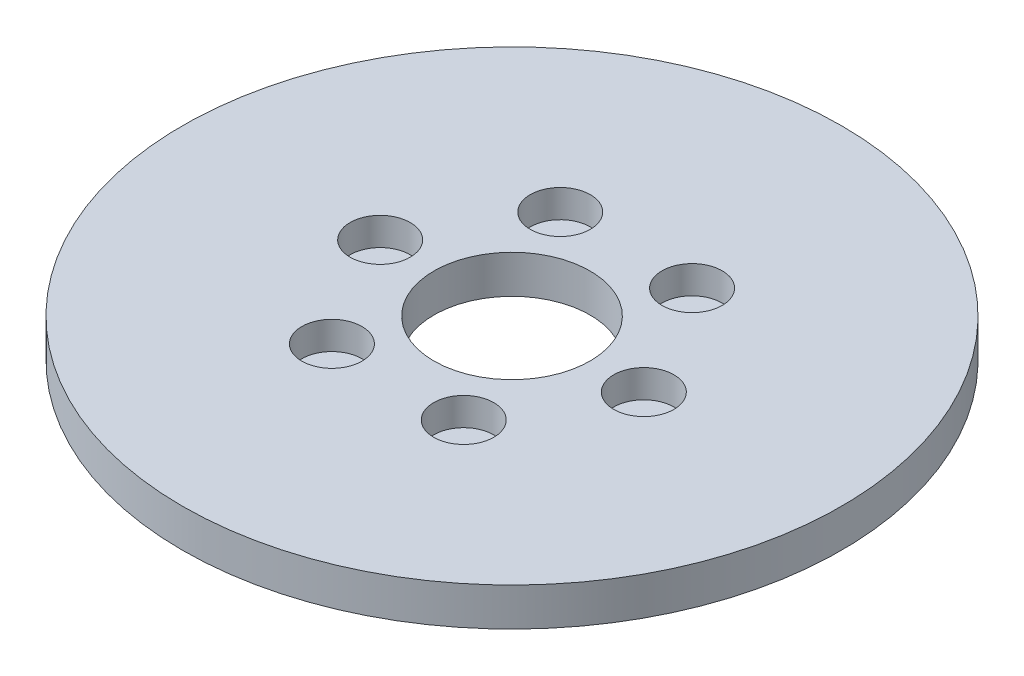
ISO-10303-21;
HEADER;
FILE_DESCRIPTION(('STEP AP214'),'2;1');
FILE_NAME('part.step','',(''),(''),'','','');
FILE_SCHEMA(('AUTOMOTIVE_DESIGN { 1 0 10303 214 1 1 1 1 }'));
ENDSEC;
DATA;
#1=APPLICATION_CONTEXT('core data for automotive mechanical design processes');
#2=APPLICATION_PROTOCOL_DEFINITION('international standard','automotive_design',2000,#1);
#3=PRODUCT_CONTEXT('',#1,'mechanical');
#4=PRODUCT('Part','Part','',(#3));
#5=PRODUCT_RELATED_PRODUCT_CATEGORY('part','',(#4));
#6=PRODUCT_DEFINITION_FORMATION('','',#4);
#7=PRODUCT_DEFINITION_CONTEXT('part definition',#1,'design');
#8=PRODUCT_DEFINITION('design','',#6,#7);
#9=PRODUCT_DEFINITION_SHAPE('','',#8);
#10=(LENGTH_UNIT() NAMED_UNIT(*) SI_UNIT(.MILLI.,.METRE.));
#11=(NAMED_UNIT(*) PLANE_ANGLE_UNIT() SI_UNIT($,.RADIAN.));
#12=(NAMED_UNIT(*) SI_UNIT($,.STERADIAN.) SOLID_ANGLE_UNIT());
#13=UNCERTAINTY_MEASURE_WITH_UNIT(LENGTH_MEASURE(1.E-05),#10,'distance_accuracy_value','');
#14=(GEOMETRIC_REPRESENTATION_CONTEXT(3) GLOBAL_UNCERTAINTY_ASSIGNED_CONTEXT((#13)) GLOBAL_UNIT_ASSIGNED_CONTEXT((#10,
#11,#12)) REPRESENTATION_CONTEXT('',''));
#15=CARTESIAN_POINT('',(0.,0.,0.));
#16=DIRECTION('',(0.,0.,1.));
#17=DIRECTION('',(1.,0.,0.));
#18=AXIS2_PLACEMENT_3D('',#15,#16,#17);
#19=CARTESIAN_POINT('',(0.,11.,0.));
#20=DIRECTION('',(0.,-1.,0.));
#21=DIRECTION('',(0.,0.,-1.));
#22=AXIS2_PLACEMENT_3D('',#19,#20,#21);
#23=CYLINDRICAL_SURFACE('',#22,95.);
#24=CARTESIAN_POINT('',(0.,11.,0.));
#25=DIRECTION('',(0.,1.,0.));
#26=DIRECTION('',(0.,0.,1.));
#27=AXIS2_PLACEMENT_3D('',#24,#25,#26);
#28=CIRCLE('',#27,95.);
#29=CARTESIAN_POINT('',(0.,11.,95.));
#30=VERTEX_POINT('',#29);
#31=EDGE_CURVE('E10',#30,#30,#28,.T.);
#32=ORIENTED_EDGE('',*,*,#31,.F.);
#33=EDGE_LOOP('',(#32));
#34=FACE_BOUND('',#33,.T.);
#35=CARTESIAN_POINT('',(0.,0.,0.));
#36=DIRECTION('',(0.,1.,0.));
#37=DIRECTION('',(0.,0.,1.));
#38=AXIS2_PLACEMENT_3D('',#35,#36,#37);
#39=CIRCLE('',#38,95.);
#40=CARTESIAN_POINT('',(0.,0.,95.));
#41=VERTEX_POINT('',#40);
#42=EDGE_CURVE('E37',#41,#41,#39,.T.);
#43=ORIENTED_EDGE('',*,*,#42,.T.);
#44=EDGE_LOOP('',(#43));
#45=FACE_BOUND('',#44,.T.);
#46=ADVANCED_FACE('F40',(#34,#45),#23,.T.);
#47=CARTESIAN_POINT('',(0.,11.,0.));
#48=DIRECTION('',(0.,1.,0.));
#49=DIRECTION('',(0.,0.,1.));
#50=AXIS2_PLACEMENT_3D('',#47,#48,#49);
#51=PLANE('',#50);
#52=CARTESIAN_POINT('',(-19.0021668198677,11.,-32.9127183859094));
#53=DIRECTION('',(0.,1.,0.));
#54=DIRECTION('',(-0.866025403784433,0.,0.50000000000001));
#55=AXIS2_PLACEMENT_3D('',#52,#53,#54);
#56=CIRCLE('',#55,8.66608825598178);
#57=CARTESIAN_POINT('',(-26.5072194009858,11.,-28.5796742579184));
#58=VERTEX_POINT('',#57);
#59=EDGE_CURVE('E70',#58,#58,#56,.T.);
#60=ORIENTED_EDGE('',*,*,#59,.F.);
#61=EDGE_LOOP('',(#60));
#62=FACE_BOUND('',#61,.T.);
#63=CARTESIAN_POINT('',(19.002166819867,11.,-32.9127183859098));
#64=DIRECTION('',(0.,1.,0.));
#65=DIRECTION('',(-0.866025403784443,0.,-0.499999999999992));
#66=AXIS2_PLACEMENT_3D('',#63,#64,#65);
#67=CIRCLE('',#66,8.66608825598178);
#68=CARTESIAN_POINT('',(11.4971142387487,11.,-37.2457625139006));
#69=VERTEX_POINT('',#68);
#70=EDGE_CURVE('E71',#69,#69,#67,.T.);
#71=ORIENTED_EDGE('',*,*,#70,.F.);
#72=EDGE_LOOP('',(#71));
#73=FACE_BOUND('',#72,.T.);
#74=CARTESIAN_POINT('',(38.0043336397345,11.,0.));
#75=DIRECTION('',(0.,1.,0.));
#76=DIRECTION('',(0.,0.,-1.));
#77=AXIS2_PLACEMENT_3D('',#74,#75,#76);
#78=CIRCLE('',#77,8.66608825598178);
#79=CARTESIAN_POINT('',(38.0043336397345,11.,-8.66608825598178));
#80=VERTEX_POINT('',#79);
#81=EDGE_CURVE('E78',#80,#80,#78,.T.);
#82=ORIENTED_EDGE('',*,*,#81,.F.);
#83=EDGE_LOOP('',(#82));
#84=FACE_BOUND('',#83,.T.);
#85=CARTESIAN_POINT('',(19.0021668198674,11.,32.9127183859095));
#86=DIRECTION('',(0.,1.,0.));
#87=DIRECTION('',(0.866025403784436,0.,-0.500000000000004));
#88=AXIS2_PLACEMENT_3D('',#85,#86,#87);
#89=CIRCLE('',#88,8.66608825598178);
#90=CARTESIAN_POINT('',(26.5072194009856,11.,28.5796742579186));
#91=VERTEX_POINT('',#90);
#92=EDGE_CURVE('E84',#91,#91,#89,.T.);
#93=ORIENTED_EDGE('',*,*,#92,.F.);
#94=EDGE_LOOP('',(#93));
#95=FACE_BOUND('',#94,.T.);
#96=CARTESIAN_POINT('',(-19.0021668198672,11.,32.9127183859097));
#97=DIRECTION('',(0.,1.,0.));
#98=DIRECTION('',(0.86602540378444,0.,0.499999999999998));
#99=AXIS2_PLACEMENT_3D('',#96,#97,#98);
#100=CIRCLE('',#99,8.66608825598178);
#101=CARTESIAN_POINT('',(-11.497114238749,11.,37.2457625139005));
#102=VERTEX_POINT('',#101);
#103=EDGE_CURVE('E61',#102,#102,#100,.T.);
#104=ORIENTED_EDGE('',*,*,#103,.F.);
#105=EDGE_LOOP('',(#104));
#106=FACE_BOUND('',#105,.T.);
#107=CARTESIAN_POINT('',(-38.0043336397345,11.,0.));
#108=DIRECTION('',(0.,1.,0.));
#109=DIRECTION('',(0.,0.,1.));
#110=AXIS2_PLACEMENT_3D('',#107,#108,#109);
#111=CIRCLE('',#110,8.66608825598178);
#112=CARTESIAN_POINT('',(-38.0043336397345,11.,8.66608825598178));
#113=VERTEX_POINT('',#112);
#114=EDGE_CURVE('E54',#113,#113,#111,.T.);
#115=ORIENTED_EDGE('',*,*,#114,.F.);
#116=EDGE_LOOP('',(#115));
#117=FACE_BOUND('',#116,.T.);
#118=CARTESIAN_POINT('',(0.,11.,0.));
#119=DIRECTION('',(0.,1.,0.));
#120=DIRECTION('',(0.,0.,1.));
#121=AXIS2_PLACEMENT_3D('',#118,#119,#120);
#122=CIRCLE('',#121,22.5);
#123=CARTESIAN_POINT('',(0.,11.,22.5));
#124=VERTEX_POINT('',#123);
#125=EDGE_CURVE('E50',#124,#124,#122,.T.);
#126=ORIENTED_EDGE('',*,*,#125,.F.);
#127=EDGE_LOOP('',(#126));
#128=FACE_BOUND('',#127,.T.);
#129=ORIENTED_EDGE('',*,*,#31,.T.);
#130=EDGE_LOOP('',(#129));
#131=FACE_BOUND('',#130,.T.);
#132=ADVANCED_FACE('F99',(#62,#73,#84,#95,#106,#117,#128,#131),#51,.T.);
#133=CARTESIAN_POINT('',(0.,0.,0.));
#134=DIRECTION('',(0.,1.,0.));
#135=DIRECTION('',(0.,0.,1.));
#136=AXIS2_PLACEMENT_3D('',#133,#134,#135);
#137=PLANE('',#136);
#138=CARTESIAN_POINT('',(0.,0.,0.));
#139=DIRECTION('',(0.,1.,0.));
#140=DIRECTION('',(0.,0.,1.));
#141=AXIS2_PLACEMENT_3D('',#138,#139,#140);
#142=CIRCLE('',#141,22.5);
#143=CARTESIAN_POINT('',(0.,0.,22.5));
#144=VERTEX_POINT('',#143);
#145=EDGE_CURVE('E47',#144,#144,#142,.T.);
#146=ORIENTED_EDGE('',*,*,#145,.T.);
#147=EDGE_LOOP('',(#146));
#148=FACE_BOUND('',#147,.T.);
#149=ORIENTED_EDGE('',*,*,#42,.F.);
#150=EDGE_LOOP('',(#149));
#151=FACE_BOUND('',#150,.T.);
#152=ADVANCED_FACE('F103',(#148,#151),#137,.F.);
#153=CARTESIAN_POINT('',(0.,11.,0.));
#154=DIRECTION('',(0.,-1.,0.));
#155=DIRECTION('',(0.,0.,-1.));
#156=AXIS2_PLACEMENT_3D('',#153,#154,#155);
#157=CYLINDRICAL_SURFACE('',#156,22.5);
#158=ORIENTED_EDGE('',*,*,#125,.T.);
#159=EDGE_LOOP('',(#158));
#160=FACE_BOUND('',#159,.T.);
#161=ORIENTED_EDGE('',*,*,#145,.F.);
#162=EDGE_LOOP('',(#161));
#163=FACE_BOUND('',#162,.T.);
#164=ADVANCED_FACE('F115',(#160,#163),#157,.F.);
#165=CARTESIAN_POINT('',(-38.0043336397345,2.945308324489,0.));
#166=DIRECTION('',(0.,1.,0.));
#167=DIRECTION('',(0.,0.,1.));
#168=AXIS2_PLACEMENT_3D('',#165,#166,#167);
#169=CYLINDRICAL_SURFACE('',#168,8.66608825598178);
#170=CARTESIAN_POINT('',(-38.0043336397345,2.945308324489,0.));
#171=DIRECTION('',(0.,1.,0.));
#172=DIRECTION('',(0.,0.,1.));
#173=AXIS2_PLACEMENT_3D('',#170,#171,#172);
#174=CIRCLE('',#173,8.66608825598178);
#175=CARTESIAN_POINT('',(-38.0043336397345,2.945308324489,8.66608825598178));
#176=VERTEX_POINT('',#175);
#177=EDGE_CURVE('E55',#176,#176,#174,.T.);
#178=ORIENTED_EDGE('',*,*,#177,.F.);
#179=EDGE_LOOP('',(#178));
#180=FACE_BOUND('',#179,.T.);
#181=ORIENTED_EDGE('',*,*,#114,.T.);
#182=EDGE_LOOP('',(#181));
#183=FACE_BOUND('',#182,.T.);
#184=ADVANCED_FACE('F113',(#180,#183),#169,.F.);
#185=CARTESIAN_POINT('',(-38.0043336397345,2.945308324489,0.));
#186=DIRECTION('',(0.,1.,0.));
#187=DIRECTION('',(0.,0.,1.));
#188=AXIS2_PLACEMENT_3D('',#185,#186,#187);
#189=PLANE('',#188);
#190=ORIENTED_EDGE('',*,*,#177,.T.);
#191=EDGE_LOOP('',(#190));
#192=FACE_BOUND('',#191,.T.);
#193=ADVANCED_FACE('F144',(#192),#189,.T.);
#194=CARTESIAN_POINT('',(-19.0021668198672,2.945308324489,32.9127183859097));
#195=DIRECTION('',(0.,1.,0.));
#196=DIRECTION('',(0.,0.,1.));
#197=AXIS2_PLACEMENT_3D('',#194,#195,#196);
#198=CYLINDRICAL_SURFACE('',#197,8.66608825598178);
#199=CARTESIAN_POINT('',(-19.0021668198672,2.945308324489,32.9127183859097));
#200=DIRECTION('',(0.,1.,0.));
#201=DIRECTION('',(0.86602540378444,0.,0.499999999999998));
#202=AXIS2_PLACEMENT_3D('',#199,#200,#201);
#203=CIRCLE('',#202,8.66608825598178);
#204=CARTESIAN_POINT('',(-11.497114238749,2.945308324489,37.2457625139005));
#205=VERTEX_POINT('',#204);
#206=EDGE_CURVE('E59',#205,#205,#203,.T.);
#207=ORIENTED_EDGE('',*,*,#206,.F.);
#208=EDGE_LOOP('',(#207));
#209=FACE_BOUND('',#208,.T.);
#210=ORIENTED_EDGE('',*,*,#103,.T.);
#211=EDGE_LOOP('',(#210));
#212=FACE_BOUND('',#211,.T.);
#213=ADVANCED_FACE('F153',(#209,#212),#198,.F.);
#214=CARTESIAN_POINT('',(-19.0021668198672,2.945308324489,32.9127183859097));
#215=DIRECTION('',(0.,1.,0.));
#216=DIRECTION('',(0.86602540378444,0.,0.499999999999998));
#217=AXIS2_PLACEMENT_3D('',#214,#215,#216);
#218=PLANE('',#217);
#219=ORIENTED_EDGE('',*,*,#206,.T.);
#220=EDGE_LOOP('',(#219));
#221=FACE_BOUND('',#220,.T.);
#222=ADVANCED_FACE('F96',(#221),#218,.T.);
#223=CARTESIAN_POINT('',(19.0021668198674,2.945308324489,32.9127183859095));
#224=DIRECTION('',(0.,1.,0.));
#225=DIRECTION('',(0.,0.,1.));
#226=AXIS2_PLACEMENT_3D('',#223,#224,#225);
#227=CYLINDRICAL_SURFACE('',#226,8.66608825598178);
#228=CARTESIAN_POINT('',(19.0021668198674,2.945308324489,32.9127183859095));
#229=DIRECTION('',(0.,1.,0.));
#230=DIRECTION('',(0.866025403784436,0.,-0.500000000000004));
#231=AXIS2_PLACEMENT_3D('',#228,#229,#230);
#232=CIRCLE('',#231,8.66608825598178);
#233=CARTESIAN_POINT('',(26.5072194009856,2.945308324489,28.5796742579186));
#234=VERTEX_POINT('',#233);
#235=EDGE_CURVE('E63',#234,#234,#232,.T.);
#236=ORIENTED_EDGE('',*,*,#235,.F.);
#237=EDGE_LOOP('',(#236));
#238=FACE_BOUND('',#237,.T.);
#239=ORIENTED_EDGE('',*,*,#92,.T.);
#240=EDGE_LOOP('',(#239));
#241=FACE_BOUND('',#240,.T.);
#242=ADVANCED_FACE('F91',(#238,#241),#227,.F.);
#243=CARTESIAN_POINT('',(19.0021668198674,2.945308324489,32.9127183859095));
#244=DIRECTION('',(0.,1.,0.));
#245=DIRECTION('',(0.866025403784436,0.,-0.500000000000004));
#246=AXIS2_PLACEMENT_3D('',#243,#244,#245);
#247=PLANE('',#246);
#248=ORIENTED_EDGE('',*,*,#235,.T.);
#249=EDGE_LOOP('',(#248));
#250=FACE_BOUND('',#249,.T.);
#251=ADVANCED_FACE('F93',(#250),#247,.T.);
#252=CARTESIAN_POINT('',(38.0043336397345,2.945308324489,0.));
#253=DIRECTION('',(0.,1.,0.));
#254=DIRECTION('',(0.,0.,1.));
#255=AXIS2_PLACEMENT_3D('',#252,#253,#254);
#256=CYLINDRICAL_SURFACE('',#255,8.66608825598178);
#257=CARTESIAN_POINT('',(38.0043336397345,2.945308324489,0.));
#258=DIRECTION('',(0.,1.,0.));
#259=DIRECTION('',(0.,0.,-1.));
#260=AXIS2_PLACEMENT_3D('',#257,#258,#259);
#261=CIRCLE('',#260,8.66608825598178);
#262=CARTESIAN_POINT('',(38.0043336397345,2.945308324489,-8.66608825598178));
#263=VERTEX_POINT('',#262);
#264=EDGE_CURVE('E85',#263,#263,#261,.T.);
#265=ORIENTED_EDGE('',*,*,#264,.F.);
#266=EDGE_LOOP('',(#265));
#267=FACE_BOUND('',#266,.T.);
#268=ORIENTED_EDGE('',*,*,#81,.T.);
#269=EDGE_LOOP('',(#268));
#270=FACE_BOUND('',#269,.T.);
#271=ADVANCED_FACE('F187',(#267,#270),#256,.F.);
#272=CARTESIAN_POINT('',(38.0043336397345,2.945308324489,0.));
#273=DIRECTION('',(0.,1.,0.));
#274=DIRECTION('',(0.,0.,-1.));
#275=AXIS2_PLACEMENT_3D('',#272,#273,#274);
#276=PLANE('',#275);
#277=ORIENTED_EDGE('',*,*,#264,.T.);
#278=EDGE_LOOP('',(#277));
#279=FACE_BOUND('',#278,.T.);
#280=ADVANCED_FACE('F198',(#279),#276,.T.);
#281=CARTESIAN_POINT('',(19.002166819867,2.945308324489,-32.9127183859098));
#282=DIRECTION('',(0.,1.,0.));
#283=DIRECTION('',(0.,0.,1.));
#284=AXIS2_PLACEMENT_3D('',#281,#282,#283);
#285=CYLINDRICAL_SURFACE('',#284,8.66608825598178);
#286=CARTESIAN_POINT('',(19.002166819867,2.945308324489,-32.9127183859098));
#287=DIRECTION('',(0.,1.,0.));
#288=DIRECTION('',(-0.866025403784443,0.,-0.499999999999992));
#289=AXIS2_PLACEMENT_3D('',#286,#287,#288);
#290=CIRCLE('',#289,8.66608825598178);
#291=CARTESIAN_POINT('',(11.4971142387487,2.945308324489,-37.2457625139006));
#292=VERTEX_POINT('',#291);
#293=EDGE_CURVE('E76',#292,#292,#290,.T.);
#294=ORIENTED_EDGE('',*,*,#293,.F.);
#295=EDGE_LOOP('',(#294));
#296=FACE_BOUND('',#295,.T.);
#297=ORIENTED_EDGE('',*,*,#70,.T.);
#298=EDGE_LOOP('',(#297));
#299=FACE_BOUND('',#298,.T.);
#300=ADVANCED_FACE('F202',(#296,#299),#285,.F.);
#301=CARTESIAN_POINT('',(19.002166819867,2.945308324489,-32.9127183859098));
#302=DIRECTION('',(0.,1.,0.));
#303=DIRECTION('',(-0.866025403784443,0.,-0.499999999999992));
#304=AXIS2_PLACEMENT_3D('',#301,#302,#303);
#305=PLANE('',#304);
#306=ORIENTED_EDGE('',*,*,#293,.T.);
#307=EDGE_LOOP('',(#306));
#308=FACE_BOUND('',#307,.T.);
#309=ADVANCED_FACE('F212',(#308),#305,.T.);
#310=CARTESIAN_POINT('',(-19.0021668198677,2.945308324489,-32.9127183859094));
#311=DIRECTION('',(0.,1.,0.));
#312=DIRECTION('',(0.,0.,1.));
#313=AXIS2_PLACEMENT_3D('',#310,#311,#312);
#314=CYLINDRICAL_SURFACE('',#313,8.66608825598178);
#315=CARTESIAN_POINT('',(-19.0021668198677,2.945308324489,-32.9127183859094));
#316=DIRECTION('',(0.,1.,0.));
#317=DIRECTION('',(-0.866025403784433,0.,0.50000000000001));
#318=AXIS2_PLACEMENT_3D('',#315,#316,#317);
#319=CIRCLE('',#318,8.66608825598178);
#320=CARTESIAN_POINT('',(-26.5072194009858,2.945308324489,-28.5796742579184));
#321=VERTEX_POINT('',#320);
#322=EDGE_CURVE('E69',#321,#321,#319,.T.);
#323=ORIENTED_EDGE('',*,*,#322,.F.);
#324=EDGE_LOOP('',(#323));
#325=FACE_BOUND('',#324,.T.);
#326=ORIENTED_EDGE('',*,*,#59,.T.);
#327=EDGE_LOOP('',(#326));
#328=FACE_BOUND('',#327,.T.);
#329=ADVANCED_FACE('F224',(#325,#328),#314,.F.);
#330=CARTESIAN_POINT('',(-19.0021668198677,2.945308324489,-32.9127183859094));
#331=DIRECTION('',(0.,1.,0.));
#332=DIRECTION('',(-0.866025403784433,0.,0.50000000000001));
#333=AXIS2_PLACEMENT_3D('',#330,#331,#332);
#334=PLANE('',#333);
#335=ORIENTED_EDGE('',*,*,#322,.T.);
#336=EDGE_LOOP('',(#335));
#337=FACE_BOUND('',#336,.T.);
#338=ADVANCED_FACE('F235',(#337),#334,.T.);
#339=CLOSED_SHELL('',(#46,#132,#152,#164,#184,#193,#213,#222,#242,#251,#271,#280,#300,#309,#329,#338));
#340=MANIFOLD_SOLID_BREP('B2',#339);
#341=ADVANCED_BREP_SHAPE_REPRESENTATION('',(#18,#340),#14);
#342=SHAPE_DEFINITION_REPRESENTATION(#9,#341);
ENDSEC;
END-ISO-10303-21;
